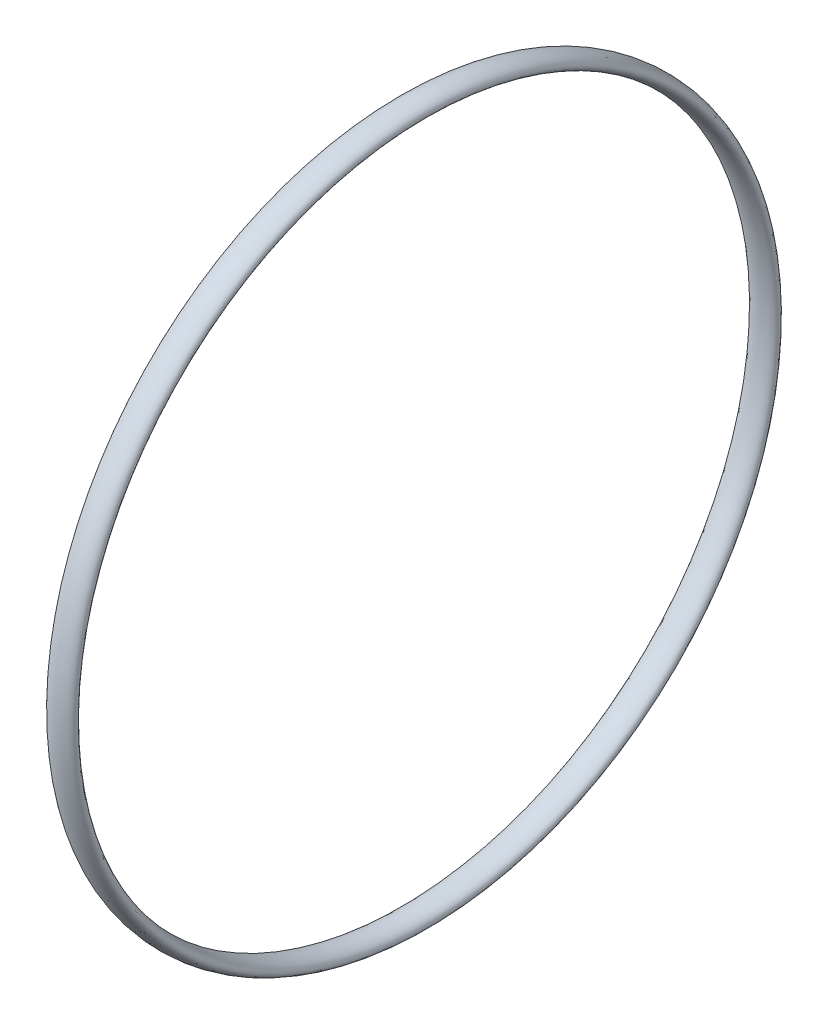
ISO-10303-21;
HEADER;
FILE_DESCRIPTION(('STEP AP214'),'2;1');
FILE_NAME('part.step','',(''),(''),'','','');
FILE_SCHEMA(('AUTOMOTIVE_DESIGN { 1 0 10303 214 1 1 1 1 }'));
ENDSEC;
DATA;
#1=APPLICATION_CONTEXT('core data for automotive mechanical design processes');
#2=APPLICATION_PROTOCOL_DEFINITION('international standard','automotive_design',2000,#1);
#3=PRODUCT_CONTEXT('',#1,'mechanical');
#4=PRODUCT('Part','Part','',(#3));
#5=PRODUCT_RELATED_PRODUCT_CATEGORY('part','',(#4));
#6=PRODUCT_DEFINITION_FORMATION('','',#4);
#7=PRODUCT_DEFINITION_CONTEXT('part definition',#1,'design');
#8=PRODUCT_DEFINITION('design','',#6,#7);
#9=PRODUCT_DEFINITION_SHAPE('','',#8);
#10=(LENGTH_UNIT() NAMED_UNIT(*) SI_UNIT(.MILLI.,.METRE.));
#11=(NAMED_UNIT(*) PLANE_ANGLE_UNIT() SI_UNIT($,.RADIAN.));
#12=(NAMED_UNIT(*) SI_UNIT($,.STERADIAN.) SOLID_ANGLE_UNIT());
#13=UNCERTAINTY_MEASURE_WITH_UNIT(LENGTH_MEASURE(1.E-05),#10,'distance_accuracy_value','');
#14=(GEOMETRIC_REPRESENTATION_CONTEXT(3) GLOBAL_UNCERTAINTY_ASSIGNED_CONTEXT((#13)) GLOBAL_UNIT_ASSIGNED_CONTEXT((#10,
#11,#12)) REPRESENTATION_CONTEXT('',''));
#15=CARTESIAN_POINT('',(0.,0.,0.));
#16=DIRECTION('',(0.,0.,1.));
#17=DIRECTION('',(1.,0.,0.));
#18=AXIS2_PLACEMENT_3D('',#15,#16,#17);
#19=CARTESIAN_POINT('',(0.,20.6428844709422,-15.7926599116397));
#20=DIRECTION('',(0.,0.,-1.));
#21=DIRECTION('',(1.,0.,0.));
#22=AXIS2_PLACEMENT_3D('',#19,#20,#21);
#23=ELLIPSE('',#22,0.749999999999998,0.374999999999999);
#24=CARTESIAN_POINT('',(-7.34866507442959,2.16591265443814,-15.7926599116397));
#25=DIRECTION('',(-1.,0.,0.));
#26=AXIS1_PLACEMENT('',#24,#25);
#27=SURFACE_OF_REVOLUTION('',#23,#26);
#28=ADVANCED_FACE('F30',(),#27,.F.);
#29=CLOSED_SHELL('',(#28));
#30=MANIFOLD_SOLID_BREP('B2',#29);
#31=ADVANCED_BREP_SHAPE_REPRESENTATION('',(#18,#30),#14);
#32=SHAPE_DEFINITION_REPRESENTATION(#9,#31);
ENDSEC;
END-ISO-10303-21;
